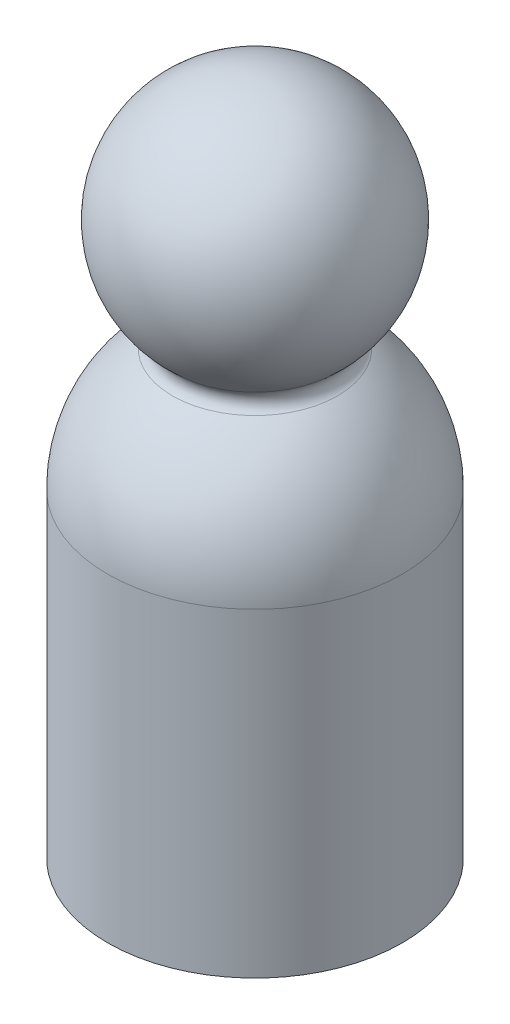
ISO-10303-21;
HEADER;
FILE_DESCRIPTION(('STEP AP214'),'2;1');
FILE_NAME('part.step','',(''),(''),'','','');
FILE_SCHEMA(('AUTOMOTIVE_DESIGN { 1 0 10303 214 1 1 1 1 }'));
ENDSEC;
DATA;
#1=APPLICATION_CONTEXT('core data for automotive mechanical design processes');
#2=APPLICATION_PROTOCOL_DEFINITION('international standard','automotive_design',2000,#1);
#3=PRODUCT_CONTEXT('',#1,'mechanical');
#4=PRODUCT('Part','Part','',(#3));
#5=PRODUCT_RELATED_PRODUCT_CATEGORY('part','',(#4));
#6=PRODUCT_DEFINITION_FORMATION('','',#4);
#7=PRODUCT_DEFINITION_CONTEXT('part definition',#1,'design');
#8=PRODUCT_DEFINITION('design','',#6,#7);
#9=PRODUCT_DEFINITION_SHAPE('','',#8);
#10=(LENGTH_UNIT() NAMED_UNIT(*) SI_UNIT(.MILLI.,.METRE.));
#11=(NAMED_UNIT(*) PLANE_ANGLE_UNIT() SI_UNIT($,.RADIAN.));
#12=(NAMED_UNIT(*) SI_UNIT($,.STERADIAN.) SOLID_ANGLE_UNIT());
#13=UNCERTAINTY_MEASURE_WITH_UNIT(LENGTH_MEASURE(1.E-05),#10,'distance_accuracy_value','');
#14=(GEOMETRIC_REPRESENTATION_CONTEXT(3) GLOBAL_UNCERTAINTY_ASSIGNED_CONTEXT((#13)) GLOBAL_UNIT_ASSIGNED_CONTEXT((#10,
#11,#12)) REPRESENTATION_CONTEXT('',''));
#15=CARTESIAN_POINT('',(0.,0.,0.));
#16=DIRECTION('',(0.,0.,1.));
#17=DIRECTION('',(1.,0.,0.));
#18=AXIS2_PLACEMENT_3D('',#15,#16,#17);
#19=CARTESIAN_POINT('',(0.,-4.43028846153846,0.));
#20=DIRECTION('',(0.,-1.,0.));
#21=DIRECTION('',(-1.,0.,0.));
#22=AXIS2_PLACEMENT_3D('',#19,#20,#21);
#23=SPHERICAL_SURFACE('',#22,12.);
#24=CARTESIAN_POINT('',(0.,5.50493421052632,0.));
#25=DIRECTION('',(0.,-1.,0.));
#26=DIRECTION('',(0.,0.,-1.));
#27=AXIS2_PLACEMENT_3D('',#24,#25,#26);
#28=CIRCLE('',#27,6.72988487691209);
#29=CARTESIAN_POINT('',(0.,5.50493421052632,-6.72988487691209));
#30=VERTEX_POINT('',#29);
#31=EDGE_CURVE('E41',#30,#30,#28,.T.);
#32=ORIENTED_EDGE('',*,*,#31,.T.);
#33=EDGE_LOOP('',(#32));
#34=FACE_BOUND('',#33,.T.);
#35=CARTESIAN_POINT('',(0.,-4.43028846153846,0.));
#36=DIRECTION('',(0.,-1.,0.));
#37=DIRECTION('',(0.,0.,-1.));
#38=AXIS2_PLACEMENT_3D('',#35,#36,#37);
#39=CIRCLE('',#38,12.);
#40=CARTESIAN_POINT('',(0.,-4.43028846153846,-12.));
#41=VERTEX_POINT('',#40);
#42=EDGE_CURVE('E45',#41,#41,#39,.T.);
#43=ORIENTED_EDGE('',*,*,#42,.F.);
#44=EDGE_LOOP('',(#43));
#45=FACE_BOUND('',#44,.T.);
#46=ADVANCED_FACE('F34',(#34,#45),#23,.T.);
#47=CARTESIAN_POINT('',(0.,-20.6899038461538,0.));
#48=DIRECTION('',(0.,-1.,0.));
#49=DIRECTION('',(0.,0.,-1.));
#50=AXIS2_PLACEMENT_3D('',#47,#48,#49);
#51=CYLINDRICAL_SURFACE('',#50,12.);
#52=CARTESIAN_POINT('',(0.,-30.4302884615385,0.));
#53=DIRECTION('',(0.,-1.,0.));
#54=DIRECTION('',(0.,0.,-1.));
#55=AXIS2_PLACEMENT_3D('',#52,#53,#54);
#56=CIRCLE('',#55,12.);
#57=CARTESIAN_POINT('',(0.,-30.4302884615385,-12.));
#58=VERTEX_POINT('',#57);
#59=EDGE_CURVE('E49',#58,#58,#56,.T.);
#60=ORIENTED_EDGE('',*,*,#59,.F.);
#61=EDGE_LOOP('',(#60));
#62=FACE_BOUND('',#61,.T.);
#63=ORIENTED_EDGE('',*,*,#42,.T.);
#64=EDGE_LOOP('',(#63));
#65=FACE_BOUND('',#64,.T.);
#66=ADVANCED_FACE('F57',(#62,#65),#51,.T.);
#67=CARTESIAN_POINT('',(-12.,-30.4302884615385,0.));
#68=DIRECTION('',(0.,1.,0.));
#69=DIRECTION('',(0.,0.,1.));
#70=AXIS2_PLACEMENT_3D('',#67,#68,#69);
#71=PLANE('',#70);
#72=ORIENTED_EDGE('',*,*,#59,.T.);
#73=EDGE_LOOP('',(#72));
#74=FACE_BOUND('',#73,.T.);
#75=ADVANCED_FACE('F55',(#74),#71,.F.);
#76=CARTESIAN_POINT('',(0.,14.5697115384615,0.));
#77=DIRECTION('',(0.,-1.,0.));
#78=DIRECTION('',(1.,0.,0.));
#79=AXIS2_PLACEMENT_3D('',#76,#77,#78);
#80=SPHERICAL_SURFACE('',#79,10.);
#81=CARTESIAN_POINT('',(0.,7.08167326094958,0.));
#82=DIRECTION('',(0.,1.,0.));
#83=DIRECTION('',(0.,0.,1.));
#84=AXIS2_PLACEMENT_3D('',#81,#82,#83);
#85=CIRCLE('',#84,6.6279169242316);
#86=CARTESIAN_POINT('',(0.,7.08167326094958,6.6279169242316));
#87=VERTEX_POINT('',#86);
#88=EDGE_CURVE('E10',#87,#87,#85,.T.);
#89=ORIENTED_EDGE('',*,*,#88,.T.);
#90=EDGE_LOOP('',(#89));
#91=FACE_BOUND('',#90,.T.);
#92=ADVANCED_FACE('F69',(#91),#80,.T.);
#93=CARTESIAN_POINT('',(0.,6.33286943319838,0.));
#94=DIRECTION('',(0.,1.,0.));
#95=DIRECTION('',(0.,0.,1.));
#96=AXIS2_PLACEMENT_3D('',#93,#94,#95);
#97=TOROIDAL_SURFACE('',#96,7.29070861665477,1.);
#98=ORIENTED_EDGE('',*,*,#88,.F.);
#99=EDGE_LOOP('',(#98));
#100=FACE_BOUND('',#99,.T.);
#101=ORIENTED_EDGE('',*,*,#31,.F.);
#102=EDGE_LOOP('',(#101));
#103=FACE_BOUND('',#102,.T.);
#104=ADVANCED_FACE('F36',(#100,#103),#97,.F.);
#105=CLOSED_SHELL('',(#46,#66,#75,#92,#104));
#106=MANIFOLD_SOLID_BREP('B2',#105);
#107=ADVANCED_BREP_SHAPE_REPRESENTATION('',(#18,#106),#14);
#108=SHAPE_DEFINITION_REPRESENTATION(#9,#107);
ENDSEC;
END-ISO-10303-21;
